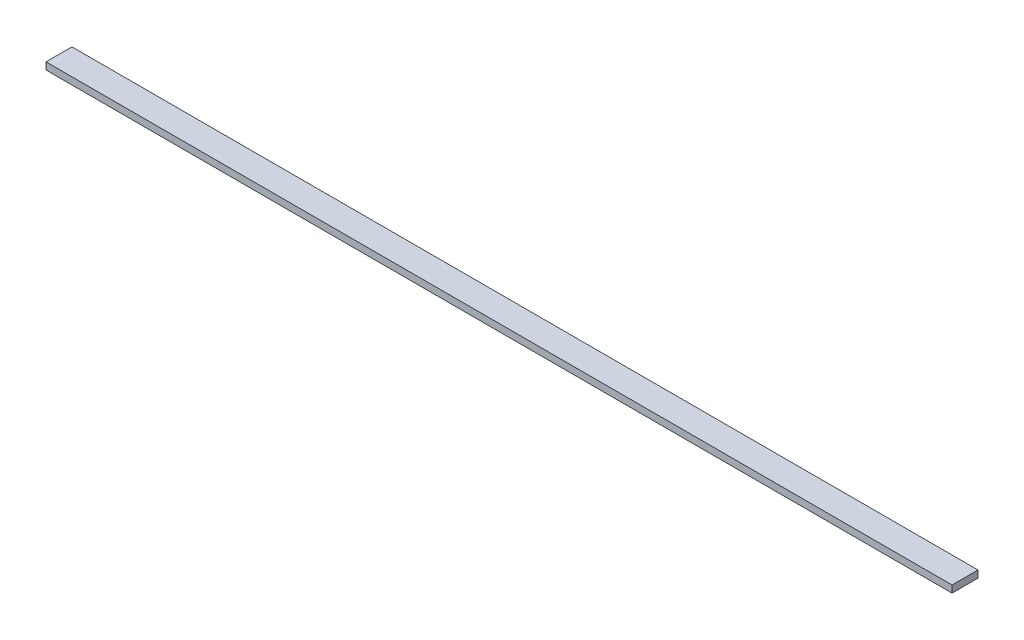
ISO-10303-21;
HEADER;
FILE_DESCRIPTION(('STEP AP214'),'2;1');
FILE_NAME('part.step','',(''),(''),'','','');
FILE_SCHEMA(('AUTOMOTIVE_DESIGN { 1 0 10303 214 1 1 1 1 }'));
ENDSEC;
DATA;
#1=APPLICATION_CONTEXT('core data for automotive mechanical design processes');
#2=APPLICATION_PROTOCOL_DEFINITION('international standard','automotive_design',2000,#1);
#3=PRODUCT_CONTEXT('',#1,'mechanical');
#4=PRODUCT('Part','Part','',(#3));
#5=PRODUCT_RELATED_PRODUCT_CATEGORY('part','',(#4));
#6=PRODUCT_DEFINITION_FORMATION('','',#4);
#7=PRODUCT_DEFINITION_CONTEXT('part definition',#1,'design');
#8=PRODUCT_DEFINITION('design','',#6,#7);
#9=PRODUCT_DEFINITION_SHAPE('','',#8);
#10=(LENGTH_UNIT() NAMED_UNIT(*) SI_UNIT(.MILLI.,.METRE.));
#11=(NAMED_UNIT(*) PLANE_ANGLE_UNIT() SI_UNIT($,.RADIAN.));
#12=(NAMED_UNIT(*) SI_UNIT($,.STERADIAN.) SOLID_ANGLE_UNIT());
#13=UNCERTAINTY_MEASURE_WITH_UNIT(LENGTH_MEASURE(1.E-05),#10,'distance_accuracy_value','');
#14=(GEOMETRIC_REPRESENTATION_CONTEXT(3) GLOBAL_UNCERTAINTY_ASSIGNED_CONTEXT((#13)) GLOBAL_UNIT_ASSIGNED_CONTEXT((#10,
#11,#12)) REPRESENTATION_CONTEXT('',''));
#15=CARTESIAN_POINT('',(0.,0.,0.));
#16=DIRECTION('',(0.,0.,1.));
#17=DIRECTION('',(1.,0.,0.));
#18=AXIS2_PLACEMENT_3D('',#15,#16,#17);
#19=CARTESIAN_POINT('',(-95.0203663126415,38.1,-139.7));
#20=DIRECTION('',(1.,0.,0.));
#21=DIRECTION('',(0.,0.,-1.));
#22=AXIS2_PLACEMENT_3D('',#19,#20,#21);
#23=PLANE('',#22);
#24=DIRECTION('',(0.,0.,1.));
#25=VECTOR('',#24,1.);
#26=CARTESIAN_POINT('',(-95.0203663126415,0.,-139.7));
#27=LINE('',#26,#25);
#28=CARTESIAN_POINT('',(-95.0203663126415,0.,-139.7));
#29=VERTEX_POINT('',#28);
#30=CARTESIAN_POINT('',(-95.0203663126415,0.,0.));
#31=VERTEX_POINT('',#30);
#32=EDGE_CURVE('E94',#29,#31,#27,.T.);
#33=ORIENTED_EDGE('',*,*,#32,.T.);
#34=DIRECTION('',(0.,-1.,0.));
#35=VECTOR('',#34,1.);
#36=CARTESIAN_POINT('',(-95.0203663126415,38.1,0.));
#37=LINE('',#36,#35);
#38=CARTESIAN_POINT('',(-95.0203663126415,38.1,0.));
#39=VERTEX_POINT('',#38);
#40=EDGE_CURVE('E11',#39,#31,#37,.T.);
#41=ORIENTED_EDGE('',*,*,#40,.F.);
#42=DIRECTION('',(0.,0.,1.));
#43=VECTOR('',#42,1.);
#44=CARTESIAN_POINT('',(-95.0203663126415,38.1,-139.7));
#45=LINE('',#44,#43);
#46=CARTESIAN_POINT('',(-95.0203663126415,38.1,-139.7));
#47=VERTEX_POINT('',#46);
#48=EDGE_CURVE('E82',#47,#39,#45,.T.);
#49=ORIENTED_EDGE('',*,*,#48,.F.);
#50=DIRECTION('',(0.,-1.,0.));
#51=VECTOR('',#50,1.);
#52=CARTESIAN_POINT('',(-95.0203663126415,38.1,-139.7));
#53=LINE('',#52,#51);
#54=EDGE_CURVE('E90',#47,#29,#53,.T.);
#55=ORIENTED_EDGE('',*,*,#54,.T.);
#56=EDGE_LOOP('',(#33,#41,#49,#55));
#57=FACE_BOUND('',#56,.T.);
#58=ADVANCED_FACE('F31',(#57),#23,.F.);
#59=CARTESIAN_POINT('',(-95.0203663126415,38.1,0.));
#60=DIRECTION('',(0.,0.,-1.));
#61=DIRECTION('',(-1.,0.,0.));
#62=AXIS2_PLACEMENT_3D('',#59,#60,#61);
#63=PLANE('',#62);
#64=DIRECTION('',(1.,0.,0.));
#65=VECTOR('',#64,1.);
#66=CARTESIAN_POINT('',(-95.0203663126415,0.,0.));
#67=LINE('',#66,#65);
#68=CARTESIAN_POINT('',(4781.77963368736,0.,0.));
#69=VERTEX_POINT('',#68);
#70=EDGE_CURVE('E86',#31,#69,#67,.T.);
#71=ORIENTED_EDGE('',*,*,#70,.T.);
#72=DIRECTION('',(0.,-1.,0.));
#73=VECTOR('',#72,1.);
#74=CARTESIAN_POINT('',(4781.77963368736,38.1,0.));
#75=LINE('',#74,#73);
#76=CARTESIAN_POINT('',(4781.77963368736,38.1,0.));
#77=VERTEX_POINT('',#76);
#78=EDGE_CURVE('E39',#77,#69,#75,.T.);
#79=ORIENTED_EDGE('',*,*,#78,.F.);
#80=DIRECTION('',(1.,0.,0.));
#81=VECTOR('',#80,1.);
#82=CARTESIAN_POINT('',(-95.0203663126415,38.1,0.));
#83=LINE('',#82,#81);
#84=EDGE_CURVE('E77',#39,#77,#83,.T.);
#85=ORIENTED_EDGE('',*,*,#84,.F.);
#86=ORIENTED_EDGE('',*,*,#40,.T.);
#87=EDGE_LOOP('',(#71,#79,#85,#86));
#88=FACE_BOUND('',#87,.T.);
#89=ADVANCED_FACE('F85',(#88),#63,.F.);
#90=CARTESIAN_POINT('',(4781.77963368736,38.1,-139.7));
#91=DIRECTION('',(-1.,0.,0.));
#92=DIRECTION('',(0.,0.,1.));
#93=AXIS2_PLACEMENT_3D('',#90,#91,#92);
#94=PLANE('',#93);
#95=DIRECTION('',(0.,0.,-1.));
#96=VECTOR('',#95,1.);
#97=CARTESIAN_POINT('',(4781.77963368736,0.,-139.7));
#98=LINE('',#97,#96);
#99=CARTESIAN_POINT('',(4781.77963368736,0.,-139.7));
#100=VERTEX_POINT('',#99);
#101=EDGE_CURVE('E64',#69,#100,#98,.T.);
#102=ORIENTED_EDGE('',*,*,#101,.T.);
#103=DIRECTION('',(0.,-1.,0.));
#104=VECTOR('',#103,1.);
#105=CARTESIAN_POINT('',(4781.77963368736,38.1,-139.7));
#106=LINE('',#105,#104);
#107=CARTESIAN_POINT('',(4781.77963368736,38.1,-139.7));
#108=VERTEX_POINT('',#107);
#109=EDGE_CURVE('E87',#108,#100,#106,.T.);
#110=ORIENTED_EDGE('',*,*,#109,.F.);
#111=DIRECTION('',(0.,0.,-1.));
#112=VECTOR('',#111,1.);
#113=CARTESIAN_POINT('',(4781.77963368736,38.1,-139.7));
#114=LINE('',#113,#112);
#115=EDGE_CURVE('E80',#77,#108,#114,.T.);
#116=ORIENTED_EDGE('',*,*,#115,.F.);
#117=ORIENTED_EDGE('',*,*,#78,.T.);
#118=EDGE_LOOP('',(#102,#110,#116,#117));
#119=FACE_BOUND('',#118,.T.);
#120=ADVANCED_FACE('F88',(#119),#94,.F.);
#121=CARTESIAN_POINT('',(-95.0203663126415,38.1,-139.7));
#122=DIRECTION('',(0.,0.,1.));
#123=DIRECTION('',(1.,0.,0.));
#124=AXIS2_PLACEMENT_3D('',#121,#122,#123);
#125=PLANE('',#124);
#126=DIRECTION('',(-1.,0.,0.));
#127=VECTOR('',#126,1.);
#128=CARTESIAN_POINT('',(-95.0203663126415,0.,-139.7));
#129=LINE('',#128,#127);
#130=EDGE_CURVE('E70',#100,#29,#129,.T.);
#131=ORIENTED_EDGE('',*,*,#130,.T.);
#132=ORIENTED_EDGE('',*,*,#54,.F.);
#133=DIRECTION('',(-1.,0.,0.));
#134=VECTOR('',#133,1.);
#135=CARTESIAN_POINT('',(-95.0203663126415,38.1,-139.7));
#136=LINE('',#135,#134);
#137=EDGE_CURVE('E47',#108,#47,#136,.T.);
#138=ORIENTED_EDGE('',*,*,#137,.F.);
#139=ORIENTED_EDGE('',*,*,#109,.T.);
#140=EDGE_LOOP('',(#131,#132,#138,#139));
#141=FACE_BOUND('',#140,.T.);
#142=ADVANCED_FACE('F101',(#141),#125,.F.);
#143=CARTESIAN_POINT('',(-95.0203663126415,38.1,0.));
#144=DIRECTION('',(0.,1.,0.));
#145=DIRECTION('',(0.,0.,1.));
#146=AXIS2_PLACEMENT_3D('',#143,#144,#145);
#147=PLANE('',#146);
#148=ORIENTED_EDGE('',*,*,#48,.T.);
#149=ORIENTED_EDGE('',*,*,#84,.T.);
#150=ORIENTED_EDGE('',*,*,#115,.T.);
#151=ORIENTED_EDGE('',*,*,#137,.T.);
#152=EDGE_LOOP('',(#148,#149,#150,#151));
#153=FACE_BOUND('',#152,.T.);
#154=ADVANCED_FACE('F78',(#153),#147,.T.);
#155=CARTESIAN_POINT('',(-95.0203663126415,0.,0.));
#156=DIRECTION('',(0.,1.,0.));
#157=DIRECTION('',(0.,0.,1.));
#158=AXIS2_PLACEMENT_3D('',#155,#156,#157);
#159=PLANE('',#158);
#160=ORIENTED_EDGE('',*,*,#32,.F.);
#161=ORIENTED_EDGE('',*,*,#130,.F.);
#162=ORIENTED_EDGE('',*,*,#101,.F.);
#163=ORIENTED_EDGE('',*,*,#70,.F.);
#164=EDGE_LOOP('',(#160,#161,#162,#163));
#165=FACE_BOUND('',#164,.T.);
#166=ADVANCED_FACE('F104',(#165),#159,.F.);
#167=CLOSED_SHELL('',(#58,#89,#120,#142,#154,#166));
#168=MANIFOLD_SOLID_BREP('B2',#167);
#169=ADVANCED_BREP_SHAPE_REPRESENTATION('',(#18,#168),#14);
#170=SHAPE_DEFINITION_REPRESENTATION(#9,#169);
ENDSEC;
END-ISO-10303-21;
